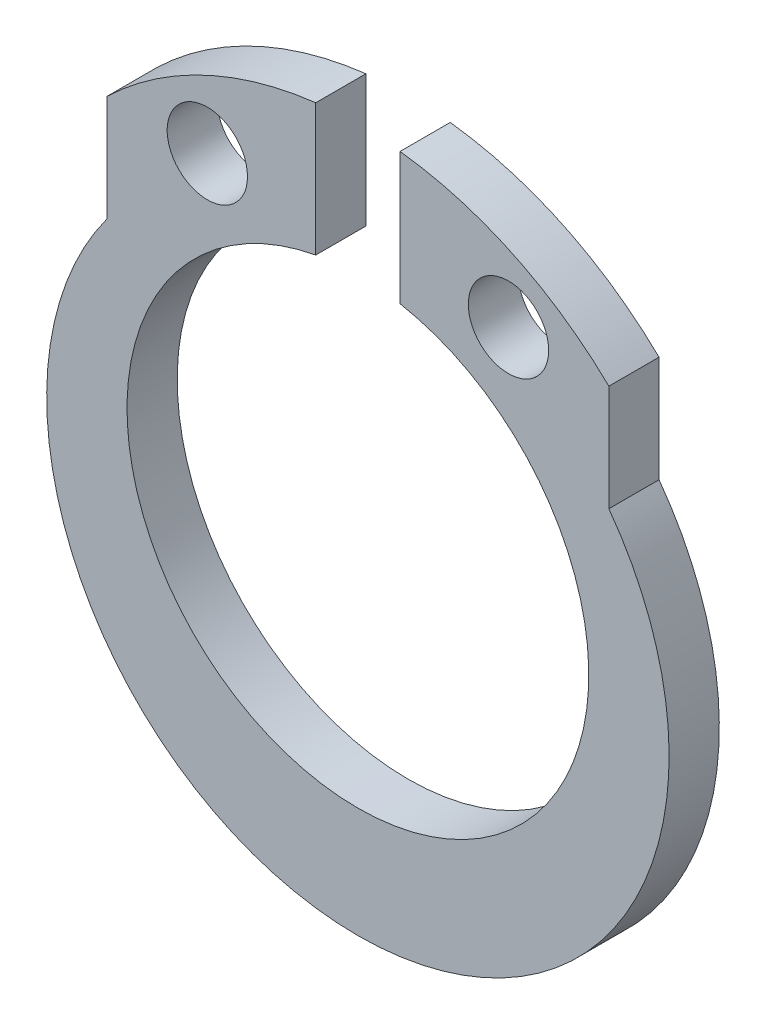
ISO-10303-21;
HEADER;
FILE_DESCRIPTION(('STEP AP214'),'2;1');
FILE_NAME('part.step','',(''),(''),'','','');
FILE_SCHEMA(('AUTOMOTIVE_DESIGN { 1 0 10303 214 1 1 1 1 }'));
ENDSEC;
DATA;
#1=APPLICATION_CONTEXT('core data for automotive mechanical design processes');
#2=APPLICATION_PROTOCOL_DEFINITION('international standard','automotive_design',2000,#1);
#3=PRODUCT_CONTEXT('',#1,'mechanical');
#4=PRODUCT('Part','Part','',(#3));
#5=PRODUCT_RELATED_PRODUCT_CATEGORY('part','',(#4));
#6=PRODUCT_DEFINITION_FORMATION('','',#4);
#7=PRODUCT_DEFINITION_CONTEXT('part definition',#1,'design');
#8=PRODUCT_DEFINITION('design','',#6,#7);
#9=PRODUCT_DEFINITION_SHAPE('','',#8);
#10=(LENGTH_UNIT() NAMED_UNIT(*) SI_UNIT(.MILLI.,.METRE.));
#11=(NAMED_UNIT(*) PLANE_ANGLE_UNIT() SI_UNIT($,.RADIAN.));
#12=(NAMED_UNIT(*) SI_UNIT($,.STERADIAN.) SOLID_ANGLE_UNIT());
#13=UNCERTAINTY_MEASURE_WITH_UNIT(LENGTH_MEASURE(1.E-05),#10,'distance_accuracy_value','');
#14=(GEOMETRIC_REPRESENTATION_CONTEXT(3) GLOBAL_UNCERTAINTY_ASSIGNED_CONTEXT((#13)) GLOBAL_UNIT_ASSIGNED_CONTEXT((#10,
#11,#12)) REPRESENTATION_CONTEXT('',''));
#15=CARTESIAN_POINT('',(0.,0.,0.));
#16=DIRECTION('',(0.,0.,1.));
#17=DIRECTION('',(1.,0.,0.));
#18=AXIS2_PLACEMENT_3D('',#15,#16,#17);
#19=CARTESIAN_POINT('',(0.,0.3,-0.5));
#20=DIRECTION('',(0.,0.,1.));
#21=DIRECTION('',(1.,0.,0.));
#22=AXIS2_PLACEMENT_3D('',#19,#20,#21);
#23=CYLINDRICAL_SURFACE('',#22,3.6);
#24=DIRECTION('',(0.,0.,1.));
#25=VECTOR('',#24,1.);
#26=CARTESIAN_POINT('',(-0.42,3.8754160597055,-0.5));
#27=LINE('',#26,#25);
#28=CARTESIAN_POINT('',(-0.42,3.8754160597055,-0.5));
#29=VERTEX_POINT('',#28);
#30=CARTESIAN_POINT('',(-0.42,3.8754160597055,0.));
#31=VERTEX_POINT('',#30);
#32=EDGE_CURVE('E106',#29,#31,#27,.T.);
#33=ORIENTED_EDGE('',*,*,#32,.F.);
#34=CARTESIAN_POINT('',(0.,0.3,-0.5));
#35=DIRECTION('',(0.,0.,1.));
#36=DIRECTION('',(1.,0.,0.));
#37=AXIS2_PLACEMENT_3D('',#34,#35,#36);
#38=CIRCLE('',#37,3.6);
#39=CARTESIAN_POINT('',(-2.5,2.89036676939772,-0.5));
#40=VERTEX_POINT('',#39);
#41=EDGE_CURVE('E123',#29,#40,#38,.T.);
#42=ORIENTED_EDGE('',*,*,#41,.T.);
#43=DIRECTION('',(0.,0.,1.));
#44=VECTOR('',#43,1.);
#45=CARTESIAN_POINT('',(-2.5,2.89036676939772,-0.5));
#46=LINE('',#45,#44);
#47=CARTESIAN_POINT('',(-2.5,2.89036676939772,0.));
#48=VERTEX_POINT('',#47);
#49=EDGE_CURVE('E125',#40,#48,#46,.T.);
#50=ORIENTED_EDGE('',*,*,#49,.T.);
#51=CARTESIAN_POINT('',(0.,0.3,0.));
#52=DIRECTION('',(0.,0.,1.));
#53=DIRECTION('',(1.,0.,0.));
#54=AXIS2_PLACEMENT_3D('',#51,#52,#53);
#55=CIRCLE('',#54,3.6);
#56=EDGE_CURVE('E140',#31,#48,#55,.T.);
#57=ORIENTED_EDGE('',*,*,#56,.F.);
#58=EDGE_LOOP('',(#33,#42,#50,#57));
#59=FACE_BOUND('',#58,.T.);
#60=ADVANCED_FACE('F36',(#59),#23,.T.);
#61=CARTESIAN_POINT('',(2.5,2.89036676939772,-0.5));
#62=DIRECTION('',(-1.,0.,0.));
#63=DIRECTION('',(0.,-1.,0.));
#64=AXIS2_PLACEMENT_3D('',#61,#62,#63);
#65=PLANE('',#64);
#66=DIRECTION('',(0.,-1.,0.));
#67=VECTOR('',#66,1.);
#68=CARTESIAN_POINT('',(2.5,2.89036676939772,0.));
#69=LINE('',#68,#67);
#70=CARTESIAN_POINT('',(2.5,2.89036676939772,0.));
#71=VERTEX_POINT('',#70);
#72=CARTESIAN_POINT('',(2.5,1.83303027798234,0.));
#73=VERTEX_POINT('',#72);
#74=EDGE_CURVE('E131',#71,#73,#69,.T.);
#75=ORIENTED_EDGE('',*,*,#74,.T.);
#76=DIRECTION('',(0.,0.,1.));
#77=VECTOR('',#76,1.);
#78=CARTESIAN_POINT('',(2.5,1.83303027798234,-0.5));
#79=LINE('',#78,#77);
#80=CARTESIAN_POINT('',(2.5,1.83303027798234,-0.5));
#81=VERTEX_POINT('',#80);
#82=EDGE_CURVE('E11',#81,#73,#79,.T.);
#83=ORIENTED_EDGE('',*,*,#82,.F.);
#84=DIRECTION('',(0.,-1.,0.));
#85=VECTOR('',#84,1.);
#86=CARTESIAN_POINT('',(2.5,2.89036676939772,-0.5));
#87=LINE('',#86,#85);
#88=CARTESIAN_POINT('',(2.5,2.89036676939772,-0.5));
#89=VERTEX_POINT('',#88);
#90=EDGE_CURVE('E142',#89,#81,#87,.T.);
#91=ORIENTED_EDGE('',*,*,#90,.F.);
#92=DIRECTION('',(0.,0.,1.));
#93=VECTOR('',#92,1.);
#94=CARTESIAN_POINT('',(2.5,2.89036676939772,-0.5));
#95=LINE('',#94,#93);
#96=EDGE_CURVE('E121',#89,#71,#95,.T.);
#97=ORIENTED_EDGE('',*,*,#96,.T.);
#98=EDGE_LOOP('',(#75,#83,#91,#97));
#99=FACE_BOUND('',#98,.T.);
#100=ADVANCED_FACE('F38',(#99),#65,.F.);
#101=CARTESIAN_POINT('',(0.,0.,-0.5));
#102=DIRECTION('',(0.,0.,1.));
#103=DIRECTION('',(1.,0.,0.));
#104=AXIS2_PLACEMENT_3D('',#101,#102,#103);
#105=CYLINDRICAL_SURFACE('',#104,3.1);
#106=CARTESIAN_POINT('',(0.,0.,0.));
#107=DIRECTION('',(0.,0.,1.));
#108=DIRECTION('',(1.,0.,0.));
#109=AXIS2_PLACEMENT_3D('',#106,#107,#108);
#110=CIRCLE('',#109,3.1);
#111=CARTESIAN_POINT('',(-2.5,1.83303027798234,0.));
#112=VERTEX_POINT('',#111);
#113=EDGE_CURVE('E134',#112,#73,#110,.T.);
#114=ORIENTED_EDGE('',*,*,#113,.F.);
#115=DIRECTION('',(0.,0.,1.));
#116=VECTOR('',#115,1.);
#117=CARTESIAN_POINT('',(-2.5,1.83303027798234,-0.5));
#118=LINE('',#117,#116);
#119=CARTESIAN_POINT('',(-2.5,1.83303027798234,-0.5));
#120=VERTEX_POINT('',#119);
#121=EDGE_CURVE('E44',#120,#112,#118,.T.);
#122=ORIENTED_EDGE('',*,*,#121,.F.);
#123=CARTESIAN_POINT('',(0.,0.,-0.5));
#124=DIRECTION('',(0.,0.,1.));
#125=DIRECTION('',(1.,0.,0.));
#126=AXIS2_PLACEMENT_3D('',#123,#124,#125);
#127=CIRCLE('',#126,3.1);
#128=EDGE_CURVE('E164',#120,#81,#127,.T.);
#129=ORIENTED_EDGE('',*,*,#128,.T.);
#130=ORIENTED_EDGE('',*,*,#82,.T.);
#131=EDGE_LOOP('',(#114,#122,#129,#130));
#132=FACE_BOUND('',#131,.T.);
#133=ADVANCED_FACE('F155',(#132),#105,.T.);
#134=CARTESIAN_POINT('',(-2.5,2.89036676939772,-0.5));
#135=DIRECTION('',(-1.,0.,0.));
#136=DIRECTION('',(0.,-1.,0.));
#137=AXIS2_PLACEMENT_3D('',#134,#135,#136);
#138=PLANE('',#137);
#139=DIRECTION('',(0.,-1.,0.));
#140=VECTOR('',#139,1.);
#141=CARTESIAN_POINT('',(-2.5,2.89036676939772,0.));
#142=LINE('',#141,#140);
#143=EDGE_CURVE('E137',#48,#112,#142,.T.);
#144=ORIENTED_EDGE('',*,*,#143,.F.);
#145=ORIENTED_EDGE('',*,*,#49,.F.);
#146=DIRECTION('',(0.,-1.,0.));
#147=VECTOR('',#146,1.);
#148=CARTESIAN_POINT('',(-2.5,2.89036676939772,-0.5));
#149=LINE('',#148,#147);
#150=EDGE_CURVE('E127',#40,#120,#149,.T.);
#151=ORIENTED_EDGE('',*,*,#150,.T.);
#152=ORIENTED_EDGE('',*,*,#121,.T.);
#153=EDGE_LOOP('',(#144,#145,#151,#152));
#154=FACE_BOUND('',#153,.T.);
#155=ADVANCED_FACE('F149',(#154),#138,.T.);
#156=DIRECTION('',(0.,0.,1.));
#157=VECTOR('',#156,1.);
#158=CARTESIAN_POINT('',(0.42,3.8754160597055,-0.5));
#159=LINE('',#158,#157);
#160=CARTESIAN_POINT('',(0.42,3.8754160597055,-0.5));
#161=VERTEX_POINT('',#160);
#162=CARTESIAN_POINT('',(0.42,3.8754160597055,0.));
#163=VERTEX_POINT('',#162);
#164=EDGE_CURVE('E98',#161,#163,#159,.T.);
#165=ORIENTED_EDGE('',*,*,#164,.T.);
#166=EDGE_CURVE('E141',#71,#163,#55,.T.);
#167=ORIENTED_EDGE('',*,*,#166,.F.);
#168=ORIENTED_EDGE('',*,*,#96,.F.);
#169=EDGE_CURVE('E114',#89,#161,#38,.T.);
#170=ORIENTED_EDGE('',*,*,#169,.T.);
#171=EDGE_LOOP('',(#165,#167,#168,#170));
#172=FACE_BOUND('',#171,.T.);
#173=ADVANCED_FACE('F120',(#172),#23,.T.);
#174=CARTESIAN_POINT('',(0.,0.,-0.5));
#175=DIRECTION('',(0.,0.,1.));
#176=DIRECTION('',(1.,0.,0.));
#177=AXIS2_PLACEMENT_3D('',#174,#175,#176);
#178=PLANE('',#177);
#179=CARTESIAN_POINT('',(-1.5,2.89807621135332,-0.5));
#180=DIRECTION('',(0.,0.,1.));
#181=DIRECTION('',(1.,0.,0.));
#182=AXIS2_PLACEMENT_3D('',#179,#180,#181);
#183=CIRCLE('',#182,0.4);
#184=CARTESIAN_POINT('',(-1.1,2.89807621135332,-0.5));
#185=VERTEX_POINT('',#184);
#186=EDGE_CURVE('E184',#185,#185,#183,.T.);
#187=ORIENTED_EDGE('',*,*,#186,.T.);
#188=EDGE_LOOP('',(#187));
#189=FACE_BOUND('',#188,.T.);
#190=CARTESIAN_POINT('',(1.5,2.89807621135332,-0.5));
#191=DIRECTION('',(0.,0.,1.));
#192=DIRECTION('',(1.,0.,0.));
#193=AXIS2_PLACEMENT_3D('',#190,#191,#192);
#194=CIRCLE('',#193,0.4);
#195=CARTESIAN_POINT('',(1.9,2.89807621135332,-0.5));
#196=VERTEX_POINT('',#195);
#197=EDGE_CURVE('E177',#196,#196,#194,.T.);
#198=ORIENTED_EDGE('',*,*,#197,.T.);
#199=EDGE_LOOP('',(#198));
#200=FACE_BOUND('',#199,.T.);
#201=ORIENTED_EDGE('',*,*,#41,.F.);
#202=DIRECTION('',(0.,-1.,0.));
#203=VECTOR('',#202,1.);
#204=CARTESIAN_POINT('',(-0.42,3.8754160597055,-0.5));
#205=LINE('',#204,#203);
#206=CARTESIAN_POINT('',(-0.42,2.56132704401641,-0.5));
#207=VERTEX_POINT('',#206);
#208=EDGE_CURVE('E118',#29,#207,#205,.T.);
#209=ORIENTED_EDGE('',*,*,#208,.T.);
#210=CARTESIAN_POINT('',(0.,0.3,-0.5));
#211=DIRECTION('',(0.,0.,1.));
#212=DIRECTION('',(1.,0.,0.));
#213=AXIS2_PLACEMENT_3D('',#210,#211,#212);
#214=CIRCLE('',#213,2.3);
#215=CARTESIAN_POINT('',(0.42,2.56132704401641,-0.5));
#216=VERTEX_POINT('',#215);
#217=EDGE_CURVE('E117',#207,#216,#214,.T.);
#218=ORIENTED_EDGE('',*,*,#217,.T.);
#219=DIRECTION('',(0.,1.,0.));
#220=VECTOR('',#219,1.);
#221=CARTESIAN_POINT('',(0.42,3.8754160597055,-0.5));
#222=LINE('',#221,#220);
#223=EDGE_CURVE('E59',#216,#161,#222,.T.);
#224=ORIENTED_EDGE('',*,*,#223,.T.);
#225=ORIENTED_EDGE('',*,*,#169,.F.);
#226=ORIENTED_EDGE('',*,*,#90,.T.);
#227=ORIENTED_EDGE('',*,*,#128,.F.);
#228=ORIENTED_EDGE('',*,*,#150,.F.);
#229=EDGE_LOOP('',(#201,#209,#218,#224,#225,#226,#227,#228));
#230=FACE_BOUND('',#229,.T.);
#231=ADVANCED_FACE('F113',(#189,#200,#230),#178,.F.);
#232=CARTESIAN_POINT('',(0.,0.,0.));
#233=DIRECTION('',(0.,0.,1.));
#234=DIRECTION('',(1.,0.,0.));
#235=AXIS2_PLACEMENT_3D('',#232,#233,#234);
#236=PLANE('',#235);
#237=CARTESIAN_POINT('',(-1.5,2.89807621135332,0.));
#238=DIRECTION('',(0.,0.,1.));
#239=DIRECTION('',(1.,0.,0.));
#240=AXIS2_PLACEMENT_3D('',#237,#238,#239);
#241=CIRCLE('',#240,0.4);
#242=CARTESIAN_POINT('',(-1.1,2.89807621135332,0.));
#243=VERTEX_POINT('',#242);
#244=EDGE_CURVE('E187',#243,#243,#241,.T.);
#245=ORIENTED_EDGE('',*,*,#244,.F.);
#246=EDGE_LOOP('',(#245));
#247=FACE_BOUND('',#246,.T.);
#248=CARTESIAN_POINT('',(1.5,2.89807621135332,0.));
#249=DIRECTION('',(0.,0.,1.));
#250=DIRECTION('',(1.,0.,0.));
#251=AXIS2_PLACEMENT_3D('',#248,#249,#250);
#252=CIRCLE('',#251,0.4);
#253=CARTESIAN_POINT('',(1.9,2.89807621135332,0.));
#254=VERTEX_POINT('',#253);
#255=EDGE_CURVE('E181',#254,#254,#252,.T.);
#256=ORIENTED_EDGE('',*,*,#255,.F.);
#257=EDGE_LOOP('',(#256));
#258=FACE_BOUND('',#257,.T.);
#259=DIRECTION('',(0.,-1.,0.));
#260=VECTOR('',#259,1.);
#261=CARTESIAN_POINT('',(-0.42,3.8754160597055,0.));
#262=LINE('',#261,#260);
#263=CARTESIAN_POINT('',(-0.42,2.56132704401641,0.));
#264=VERTEX_POINT('',#263);
#265=EDGE_CURVE('E51',#31,#264,#262,.T.);
#266=ORIENTED_EDGE('',*,*,#265,.F.);
#267=ORIENTED_EDGE('',*,*,#56,.T.);
#268=ORIENTED_EDGE('',*,*,#143,.T.);
#269=ORIENTED_EDGE('',*,*,#113,.T.);
#270=ORIENTED_EDGE('',*,*,#74,.F.);
#271=ORIENTED_EDGE('',*,*,#166,.T.);
#272=DIRECTION('',(0.,1.,0.));
#273=VECTOR('',#272,1.);
#274=CARTESIAN_POINT('',(0.42,3.8754160597055,0.));
#275=LINE('',#274,#273);
#276=CARTESIAN_POINT('',(0.42,2.56132704401641,0.));
#277=VERTEX_POINT('',#276);
#278=EDGE_CURVE('E101',#277,#163,#275,.T.);
#279=ORIENTED_EDGE('',*,*,#278,.F.);
#280=CARTESIAN_POINT('',(0.,0.3,0.));
#281=DIRECTION('',(0.,0.,1.));
#282=DIRECTION('',(1.,0.,0.));
#283=AXIS2_PLACEMENT_3D('',#280,#281,#282);
#284=CIRCLE('',#283,2.3);
#285=EDGE_CURVE('E167',#264,#277,#284,.T.);
#286=ORIENTED_EDGE('',*,*,#285,.F.);
#287=EDGE_LOOP('',(#266,#267,#268,#269,#270,#271,#279,#286));
#288=FACE_BOUND('',#287,.T.);
#289=ADVANCED_FACE('F159',(#247,#258,#288),#236,.T.);
#290=CARTESIAN_POINT('',(0.,0.3,-0.5));
#291=DIRECTION('',(0.,0.,1.));
#292=DIRECTION('',(1.,0.,0.));
#293=AXIS2_PLACEMENT_3D('',#290,#291,#292);
#294=CYLINDRICAL_SURFACE('',#293,2.3);
#295=ORIENTED_EDGE('',*,*,#217,.F.);
#296=DIRECTION('',(0.,0.,1.));
#297=VECTOR('',#296,1.);
#298=CARTESIAN_POINT('',(-0.42,2.56132704401641,-0.5));
#299=LINE('',#298,#297);
#300=EDGE_CURVE('E170',#207,#264,#299,.T.);
#301=ORIENTED_EDGE('',*,*,#300,.T.);
#302=ORIENTED_EDGE('',*,*,#285,.T.);
#303=DIRECTION('',(0.,0.,1.));
#304=VECTOR('',#303,1.);
#305=CARTESIAN_POINT('',(0.42,2.56132704401641,-0.5));
#306=LINE('',#305,#304);
#307=EDGE_CURVE('E107',#216,#277,#306,.T.);
#308=ORIENTED_EDGE('',*,*,#307,.F.);
#309=EDGE_LOOP('',(#295,#301,#302,#308));
#310=FACE_BOUND('',#309,.T.);
#311=ADVANCED_FACE('F195',(#310),#294,.F.);
#312=CARTESIAN_POINT('',(0.42,3.8754160597055,-0.5));
#313=DIRECTION('',(1.,0.,0.));
#314=DIRECTION('',(0.,1.,0.));
#315=AXIS2_PLACEMENT_3D('',#312,#313,#314);
#316=PLANE('',#315);
#317=ORIENTED_EDGE('',*,*,#278,.T.);
#318=ORIENTED_EDGE('',*,*,#164,.F.);
#319=ORIENTED_EDGE('',*,*,#223,.F.);
#320=ORIENTED_EDGE('',*,*,#307,.T.);
#321=EDGE_LOOP('',(#317,#318,#319,#320));
#322=FACE_BOUND('',#321,.T.);
#323=ADVANCED_FACE('F99',(#322),#316,.F.);
#324=CARTESIAN_POINT('',(-0.42,3.8754160597055,-0.5));
#325=DIRECTION('',(-1.,0.,0.));
#326=DIRECTION('',(0.,-1.,0.));
#327=AXIS2_PLACEMENT_3D('',#324,#325,#326);
#328=PLANE('',#327);
#329=ORIENTED_EDGE('',*,*,#265,.T.);
#330=ORIENTED_EDGE('',*,*,#300,.F.);
#331=ORIENTED_EDGE('',*,*,#208,.F.);
#332=ORIENTED_EDGE('',*,*,#32,.T.);
#333=EDGE_LOOP('',(#329,#330,#331,#332));
#334=FACE_BOUND('',#333,.T.);
#335=ADVANCED_FACE('F201',(#334),#328,.F.);
#336=CARTESIAN_POINT('',(1.5,2.89807621135332,0.));
#337=DIRECTION('',(0.,0.,1.));
#338=DIRECTION('',(1.,0.,0.));
#339=AXIS2_PLACEMENT_3D('',#336,#337,#338);
#340=CYLINDRICAL_SURFACE('',#339,0.4);
#341=ORIENTED_EDGE('',*,*,#197,.F.);
#342=EDGE_LOOP('',(#341));
#343=FACE_BOUND('',#342,.T.);
#344=ORIENTED_EDGE('',*,*,#255,.T.);
#345=EDGE_LOOP('',(#344));
#346=FACE_BOUND('',#345,.T.);
#347=ADVANCED_FACE('F199',(#343,#346),#340,.F.);
#348=CARTESIAN_POINT('',(-1.5,2.89807621135332,0.));
#349=DIRECTION('',(0.,0.,1.));
#350=DIRECTION('',(1.,0.,0.));
#351=AXIS2_PLACEMENT_3D('',#348,#349,#350);
#352=CYLINDRICAL_SURFACE('',#351,0.4);
#353=ORIENTED_EDGE('',*,*,#186,.F.);
#354=EDGE_LOOP('',(#353));
#355=FACE_BOUND('',#354,.T.);
#356=ORIENTED_EDGE('',*,*,#244,.T.);
#357=EDGE_LOOP('',(#356));
#358=FACE_BOUND('',#357,.T.);
#359=ADVANCED_FACE('F191',(#355,#358),#352,.F.);
#360=CLOSED_SHELL('',(#60,#100,#133,#155,#173,#231,#289,#311,#323,#335,#347,#359));
#361=MANIFOLD_SOLID_BREP('B2',#360);
#362=ADVANCED_BREP_SHAPE_REPRESENTATION('',(#18,#361),#14);
#363=SHAPE_DEFINITION_REPRESENTATION(#9,#362);
ENDSEC;
END-ISO-10303-21;
